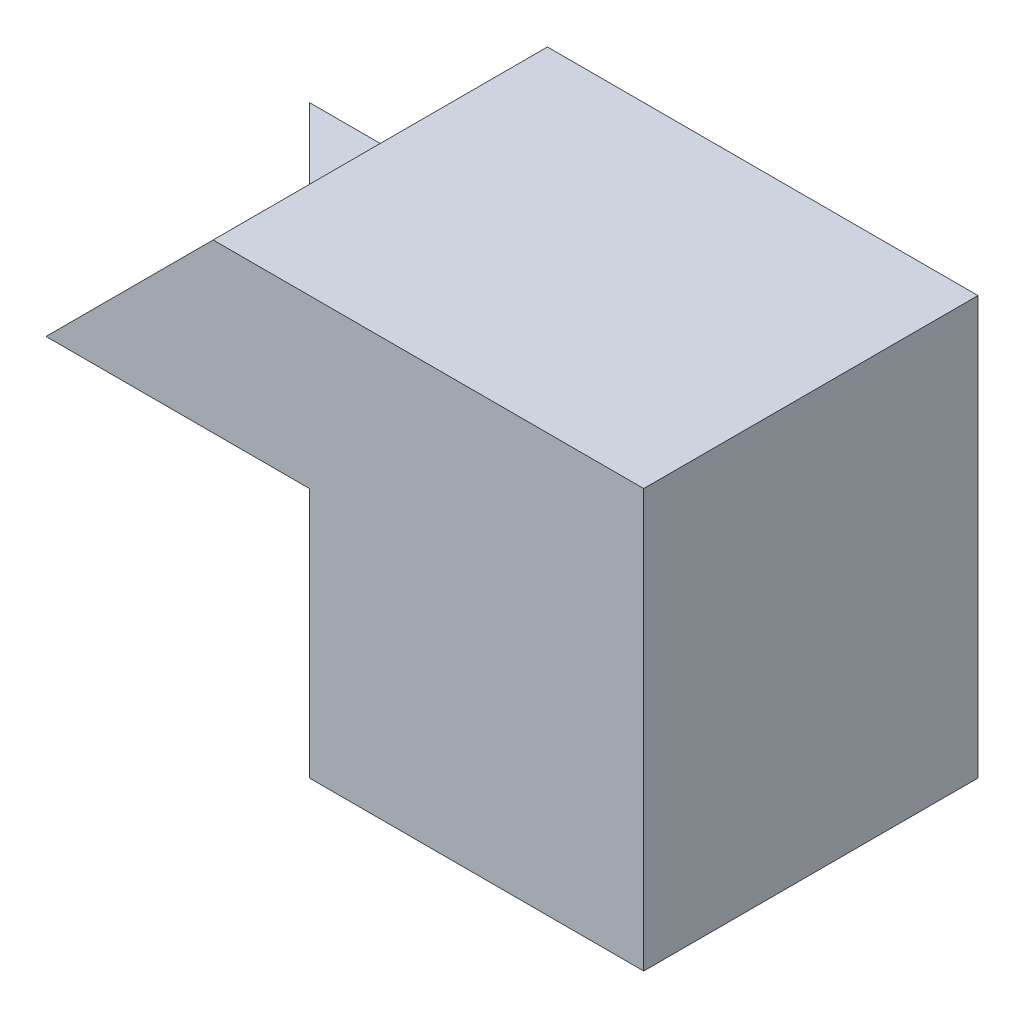
ISO-10303-21;
HEADER;
FILE_DESCRIPTION(('STEP AP214'),'2;1');
FILE_NAME('part.step','',(''),(''),'','','');
FILE_SCHEMA(('AUTOMOTIVE_DESIGN { 1 0 10303 214 1 1 1 1 }'));
ENDSEC;
DATA;
#1=APPLICATION_CONTEXT('core data for automotive mechanical design processes');
#2=APPLICATION_PROTOCOL_DEFINITION('international standard','automotive_design',2000,#1);
#3=PRODUCT_CONTEXT('',#1,'mechanical');
#4=PRODUCT('Part','Part','',(#3));
#5=PRODUCT_RELATED_PRODUCT_CATEGORY('part','',(#4));
#6=PRODUCT_DEFINITION_FORMATION('','',#4);
#7=PRODUCT_DEFINITION_CONTEXT('part definition',#1,'design');
#8=PRODUCT_DEFINITION('design','',#6,#7);
#9=PRODUCT_DEFINITION_SHAPE('','',#8);
#10=(LENGTH_UNIT() NAMED_UNIT(*) SI_UNIT(.MILLI.,.METRE.));
#11=(NAMED_UNIT(*) PLANE_ANGLE_UNIT() SI_UNIT($,.RADIAN.));
#12=(NAMED_UNIT(*) SI_UNIT($,.STERADIAN.) SOLID_ANGLE_UNIT());
#13=UNCERTAINTY_MEASURE_WITH_UNIT(LENGTH_MEASURE(1.E-05),#10,'distance_accuracy_value','');
#14=(GEOMETRIC_REPRESENTATION_CONTEXT(3) GLOBAL_UNCERTAINTY_ASSIGNED_CONTEXT((#13)) GLOBAL_UNIT_ASSIGNED_CONTEXT((#10,
#11,#12)) REPRESENTATION_CONTEXT('',''));
#15=CARTESIAN_POINT('',(0.,0.,0.));
#16=DIRECTION('',(0.,0.,1.));
#17=DIRECTION('',(1.,0.,0.));
#18=AXIS2_PLACEMENT_3D('',#15,#16,#17);
#19=CARTESIAN_POINT('',(-4.,3.,-4.));
#20=DIRECTION('',(0.,0.,1.));
#21=DIRECTION('',(1.,0.,0.));
#22=AXIS2_PLACEMENT_3D('',#19,#20,#21);
#23=PLANE('',#22);
#24=DIRECTION('',(0.,-1.,0.));
#25=VECTOR('',#24,1.);
#26=CARTESIAN_POINT('',(4.,0.,-4.));
#27=LINE('',#26,#25);
#28=CARTESIAN_POINT('',(4.,5.,-4.));
#29=VERTEX_POINT('',#28);
#30=CARTESIAN_POINT('',(4.,0.,-4.));
#31=VERTEX_POINT('',#30);
#32=EDGE_CURVE('E93',#29,#31,#27,.T.);
#33=ORIENTED_EDGE('',*,*,#32,.T.);
#34=DIRECTION('',(-1.,0.,0.));
#35=VECTOR('',#34,1.);
#36=CARTESIAN_POINT('',(-4.,0.,-4.));
#37=LINE('',#36,#35);
#38=CARTESIAN_POINT('',(-4.,0.,-4.));
#39=VERTEX_POINT('',#38);
#40=EDGE_CURVE('E128',#31,#39,#37,.T.);
#41=ORIENTED_EDGE('',*,*,#40,.T.);
#42=DIRECTION('',(0.,-1.,0.));
#43=VECTOR('',#42,1.);
#44=CARTESIAN_POINT('',(-4.,3.,-4.));
#45=LINE('',#44,#43);
#46=CARTESIAN_POINT('',(-4.,3.,-4.));
#47=VERTEX_POINT('',#46);
#48=EDGE_CURVE('E40',#47,#39,#45,.T.);
#49=ORIENTED_EDGE('',*,*,#48,.F.);
#50=DIRECTION('',(-1.,0.,0.));
#51=VECTOR('',#50,1.);
#52=CARTESIAN_POINT('',(-4.,3.,-4.));
#53=LINE('',#52,#51);
#54=CARTESIAN_POINT('',(-3.15229105463222,3.,-4.));
#55=VERTEX_POINT('',#54);
#56=EDGE_CURVE('E133',#55,#47,#53,.T.);
#57=ORIENTED_EDGE('',*,*,#56,.F.);
#58=DIRECTION('',(0.707106781186548,0.707106781186547,0.));
#59=VECTOR('',#58,1.);
#60=CARTESIAN_POINT('',(-1.15229105463222,5.,-4.));
#61=LINE('',#60,#59);
#62=CARTESIAN_POINT('',(-1.15229105463222,5.,-4.));
#63=VERTEX_POINT('',#62);
#64=EDGE_CURVE('E114',#55,#63,#61,.T.);
#65=ORIENTED_EDGE('',*,*,#64,.T.);
#66=DIRECTION('',(1.,0.,0.));
#67=VECTOR('',#66,1.);
#68=CARTESIAN_POINT('',(4.,5.,-4.));
#69=LINE('',#68,#67);
#70=EDGE_CURVE('E124',#63,#29,#69,.T.);
#71=ORIENTED_EDGE('',*,*,#70,.T.);
#72=EDGE_LOOP('',(#33,#41,#49,#57,#65,#71));
#73=FACE_BOUND('',#72,.T.);
#74=ADVANCED_FACE('F33',(#73),#23,.F.);
#75=CARTESIAN_POINT('',(0.,3.,0.));
#76=DIRECTION('',(0.707106781186547,0.,-0.707106781186547));
#77=DIRECTION('',(-0.707106781186548,0.,-0.707106781186548));
#78=AXIS2_PLACEMENT_3D('',#75,#76,#77);
#79=PLANE('',#78);
#80=DIRECTION('',(0.707106781186548,0.,0.707106781186548));
#81=VECTOR('',#80,1.);
#82=CARTESIAN_POINT('',(0.,0.,0.));
#83=LINE('',#82,#81);
#84=CARTESIAN_POINT('',(0.,0.,0.));
#85=VERTEX_POINT('',#84);
#86=EDGE_CURVE('E135',#39,#85,#83,.T.);
#87=ORIENTED_EDGE('',*,*,#86,.T.);
#88=DIRECTION('',(0.,-1.,0.));
#89=VECTOR('',#88,1.);
#90=CARTESIAN_POINT('',(0.,3.,0.));
#91=LINE('',#90,#89);
#92=CARTESIAN_POINT('',(0.,3.,0.));
#93=VERTEX_POINT('',#92);
#94=EDGE_CURVE('E138',#93,#85,#91,.T.);
#95=ORIENTED_EDGE('',*,*,#94,.F.);
#96=DIRECTION('',(0.707106781186548,0.,0.707106781186548));
#97=VECTOR('',#96,1.);
#98=CARTESIAN_POINT('',(0.,3.,0.));
#99=LINE('',#98,#97);
#100=CARTESIAN_POINT('',(-3.15229105463222,3.,-3.15229105463222));
#101=VERTEX_POINT('',#100);
#102=EDGE_CURVE('E47',#101,#93,#99,.T.);
#103=ORIENTED_EDGE('',*,*,#102,.F.);
#104=EDGE_CURVE('E136',#47,#101,#99,.T.);
#105=ORIENTED_EDGE('',*,*,#104,.F.);
#106=ORIENTED_EDGE('',*,*,#48,.T.);
#107=EDGE_LOOP('',(#87,#95,#103,#105,#106));
#108=FACE_BOUND('',#107,.T.);
#109=ADVANCED_FACE('F144',(#108),#79,.F.);
#110=CARTESIAN_POINT('',(0.,3.,0.));
#111=DIRECTION('',(0.,1.,0.));
#112=DIRECTION('',(0.,0.,1.));
#113=AXIS2_PLACEMENT_3D('',#110,#111,#112);
#114=PLANE('',#113);
#115=DIRECTION('',(0.,0.,1.));
#116=VECTOR('',#115,1.);
#117=CARTESIAN_POINT('',(-3.15229105463222,3.,0.));
#118=LINE('',#117,#116);
#119=EDGE_CURVE('E11',#55,#101,#118,.T.);
#120=ORIENTED_EDGE('',*,*,#119,.F.);
#121=ORIENTED_EDGE('',*,*,#56,.T.);
#122=ORIENTED_EDGE('',*,*,#104,.T.);
#123=EDGE_LOOP('',(#120,#121,#122));
#124=FACE_BOUND('',#123,.T.);
#125=ADVANCED_FACE('F161',(#124),#114,.T.);
#126=CARTESIAN_POINT('',(0.,0.,0.));
#127=DIRECTION('',(0.,1.,0.));
#128=DIRECTION('',(0.,0.,1.));
#129=AXIS2_PLACEMENT_3D('',#126,#127,#128);
#130=PLANE('',#129);
#131=ORIENTED_EDGE('',*,*,#40,.F.);
#132=DIRECTION('',(0.,0.,-1.));
#133=VECTOR('',#132,1.);
#134=CARTESIAN_POINT('',(4.,0.,0.));
#135=LINE('',#134,#133);
#136=CARTESIAN_POINT('',(4.,0.,0.));
#137=VERTEX_POINT('',#136);
#138=EDGE_CURVE('E98',#137,#31,#135,.T.);
#139=ORIENTED_EDGE('',*,*,#138,.F.);
#140=DIRECTION('',(-1.,0.,0.));
#141=VECTOR('',#140,1.);
#142=CARTESIAN_POINT('',(4.,0.,0.));
#143=LINE('',#142,#141);
#144=EDGE_CURVE('E110',#137,#85,#143,.T.);
#145=ORIENTED_EDGE('',*,*,#144,.T.);
#146=ORIENTED_EDGE('',*,*,#86,.F.);
#147=EDGE_LOOP('',(#131,#139,#145,#146));
#148=FACE_BOUND('',#147,.T.);
#149=ADVANCED_FACE('F147',(#148),#130,.F.);
#150=CARTESIAN_POINT('',(0.,3.,0.));
#151=DIRECTION('',(0.,-1.,0.));
#152=DIRECTION('',(0.,0.,-1.));
#153=AXIS2_PLACEMENT_3D('',#150,#151,#152);
#154=PLANE('',#153);
#155=ORIENTED_EDGE('',*,*,#102,.T.);
#156=DIRECTION('',(-1.,0.,0.));
#157=VECTOR('',#156,1.);
#158=CARTESIAN_POINT('',(0.,3.,0.));
#159=LINE('',#158,#157);
#160=CARTESIAN_POINT('',(-3.15229105463222,3.,0.));
#161=VERTEX_POINT('',#160);
#162=EDGE_CURVE('E120',#93,#161,#159,.T.);
#163=ORIENTED_EDGE('',*,*,#162,.T.);
#164=DIRECTION('',(0.,0.,-1.));
#165=VECTOR('',#164,1.);
#166=CARTESIAN_POINT('',(-3.15229105463222,3.,0.));
#167=LINE('',#166,#165);
#168=EDGE_CURVE('E129',#161,#101,#167,.T.);
#169=ORIENTED_EDGE('',*,*,#168,.T.);
#170=EDGE_LOOP('',(#155,#163,#169));
#171=FACE_BOUND('',#170,.T.);
#172=ADVANCED_FACE('F153',(#171),#154,.T.);
#173=CARTESIAN_POINT('',(4.,5.,0.));
#174=DIRECTION('',(0.,1.,0.));
#175=DIRECTION('',(0.,0.,1.));
#176=AXIS2_PLACEMENT_3D('',#173,#174,#175);
#177=PLANE('',#176);
#178=ORIENTED_EDGE('',*,*,#70,.F.);
#179=DIRECTION('',(0.,0.,-1.));
#180=VECTOR('',#179,1.);
#181=CARTESIAN_POINT('',(-1.15229105463222,5.,0.));
#182=LINE('',#181,#180);
#183=CARTESIAN_POINT('',(-1.15229105463222,5.,0.));
#184=VERTEX_POINT('',#183);
#185=EDGE_CURVE('E113',#184,#63,#182,.T.);
#186=ORIENTED_EDGE('',*,*,#185,.F.);
#187=DIRECTION('',(1.,0.,0.));
#188=VECTOR('',#187,1.);
#189=CARTESIAN_POINT('',(4.,5.,0.));
#190=LINE('',#189,#188);
#191=CARTESIAN_POINT('',(4.,5.,0.));
#192=VERTEX_POINT('',#191);
#193=EDGE_CURVE('E106',#184,#192,#190,.T.);
#194=ORIENTED_EDGE('',*,*,#193,.T.);
#195=DIRECTION('',(0.,0.,-1.));
#196=VECTOR('',#195,1.);
#197=CARTESIAN_POINT('',(4.,5.,0.));
#198=LINE('',#197,#196);
#199=EDGE_CURVE('E87',#192,#29,#198,.T.);
#200=ORIENTED_EDGE('',*,*,#199,.T.);
#201=EDGE_LOOP('',(#178,#186,#194,#200));
#202=FACE_BOUND('',#201,.T.);
#203=ADVANCED_FACE('F112',(#202),#177,.T.);
#204=CARTESIAN_POINT('',(-1.15229105463222,5.,0.));
#205=DIRECTION('',(-0.707106781186547,0.707106781186548,0.));
#206=DIRECTION('',(-0.707106781186548,-0.707106781186547,0.));
#207=AXIS2_PLACEMENT_3D('',#204,#205,#206);
#208=PLANE('',#207);
#209=ORIENTED_EDGE('',*,*,#64,.F.);
#210=ORIENTED_EDGE('',*,*,#119,.T.);
#211=ORIENTED_EDGE('',*,*,#168,.F.);
#212=DIRECTION('',(0.707106781186548,0.707106781186547,0.));
#213=VECTOR('',#212,1.);
#214=CARTESIAN_POINT('',(-1.15229105463222,5.,0.));
#215=LINE('',#214,#213);
#216=EDGE_CURVE('E99',#161,#184,#215,.T.);
#217=ORIENTED_EDGE('',*,*,#216,.T.);
#218=ORIENTED_EDGE('',*,*,#185,.T.);
#219=EDGE_LOOP('',(#209,#210,#211,#217,#218));
#220=FACE_BOUND('',#219,.T.);
#221=ADVANCED_FACE('F150',(#220),#208,.T.);
#222=CARTESIAN_POINT('',(4.,0.,0.));
#223=DIRECTION('',(1.,0.,0.));
#224=DIRECTION('',(0.,0.,-1.));
#225=AXIS2_PLACEMENT_3D('',#222,#223,#224);
#226=PLANE('',#225);
#227=ORIENTED_EDGE('',*,*,#32,.F.);
#228=ORIENTED_EDGE('',*,*,#199,.F.);
#229=DIRECTION('',(0.,-1.,0.));
#230=VECTOR('',#229,1.);
#231=CARTESIAN_POINT('',(4.,0.,0.));
#232=LINE('',#231,#230);
#233=EDGE_CURVE('E91',#192,#137,#232,.T.);
#234=ORIENTED_EDGE('',*,*,#233,.T.);
#235=ORIENTED_EDGE('',*,*,#138,.T.);
#236=EDGE_LOOP('',(#227,#228,#234,#235));
#237=FACE_BOUND('',#236,.T.);
#238=ADVANCED_FACE('F89',(#237),#226,.T.);
#239=CARTESIAN_POINT('',(0.,0.,0.));
#240=DIRECTION('',(0.,0.,-1.));
#241=DIRECTION('',(-1.,0.,0.));
#242=AXIS2_PLACEMENT_3D('',#239,#240,#241);
#243=PLANE('',#242);
#244=ORIENTED_EDGE('',*,*,#193,.F.);
#245=ORIENTED_EDGE('',*,*,#216,.F.);
#246=ORIENTED_EDGE('',*,*,#162,.F.);
#247=ORIENTED_EDGE('',*,*,#94,.T.);
#248=ORIENTED_EDGE('',*,*,#144,.F.);
#249=ORIENTED_EDGE('',*,*,#233,.F.);
#250=EDGE_LOOP('',(#244,#245,#246,#247,#248,#249));
#251=FACE_BOUND('',#250,.T.);
#252=ADVANCED_FACE('F104',(#251),#243,.F.);
#253=CLOSED_SHELL('',(#74,#109,#125,#149,#172,#203,#221,#238,#252));
#254=MANIFOLD_SOLID_BREP('B2',#253);
#255=ADVANCED_BREP_SHAPE_REPRESENTATION('',(#18,#254),#14);
#256=SHAPE_DEFINITION_REPRESENTATION(#9,#255);
ENDSEC;
END-ISO-10303-21;
